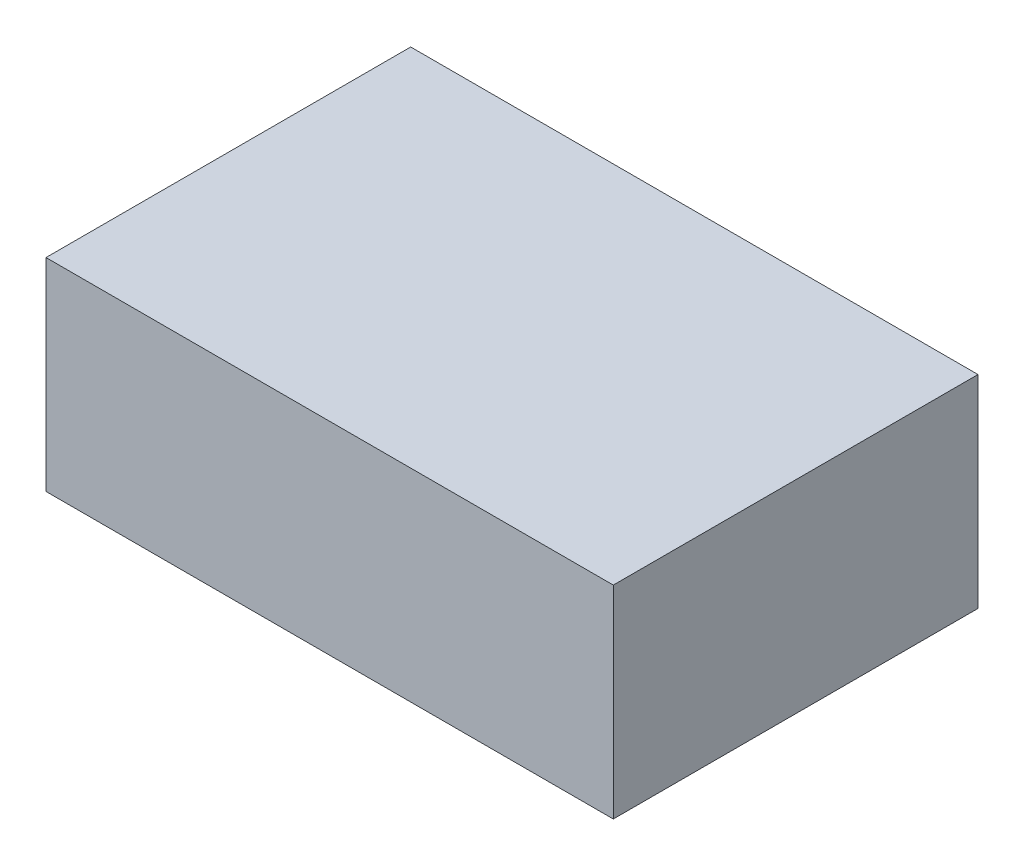
ISO-10303-21;
HEADER;
FILE_DESCRIPTION(('STEP AP214'),'2;1');
FILE_NAME('part.step','',(''),(''),'','','');
FILE_SCHEMA(('AUTOMOTIVE_DESIGN { 1 0 10303 214 1 1 1 1 }'));
ENDSEC;
DATA;
#1=APPLICATION_CONTEXT('core data for automotive mechanical design processes');
#2=APPLICATION_PROTOCOL_DEFINITION('international standard','automotive_design',2000,#1);
#3=PRODUCT_CONTEXT('',#1,'mechanical');
#4=PRODUCT('Part','Part','',(#3));
#5=PRODUCT_RELATED_PRODUCT_CATEGORY('part','',(#4));
#6=PRODUCT_DEFINITION_FORMATION('','',#4);
#7=PRODUCT_DEFINITION_CONTEXT('part definition',#1,'design');
#8=PRODUCT_DEFINITION('design','',#6,#7);
#9=PRODUCT_DEFINITION_SHAPE('','',#8);
#10=(LENGTH_UNIT() NAMED_UNIT(*) SI_UNIT(.MILLI.,.METRE.));
#11=(NAMED_UNIT(*) PLANE_ANGLE_UNIT() SI_UNIT($,.RADIAN.));
#12=(NAMED_UNIT(*) SI_UNIT($,.STERADIAN.) SOLID_ANGLE_UNIT());
#13=UNCERTAINTY_MEASURE_WITH_UNIT(LENGTH_MEASURE(1.E-05),#10,'distance_accuracy_value','');
#14=(GEOMETRIC_REPRESENTATION_CONTEXT(3) GLOBAL_UNCERTAINTY_ASSIGNED_CONTEXT((#13)) GLOBAL_UNIT_ASSIGNED_CONTEXT((#10,
#11,#12)) REPRESENTATION_CONTEXT('',''));
#15=CARTESIAN_POINT('',(0.,0.,0.));
#16=DIRECTION('',(0.,0.,1.));
#17=DIRECTION('',(1.,0.,0.));
#18=AXIS2_PLACEMENT_3D('',#15,#16,#17);
#19=CARTESIAN_POINT('',(7.,5.,4.5));
#20=DIRECTION('',(-1.,0.,0.));
#21=DIRECTION('',(0.,0.,1.));
#22=AXIS2_PLACEMENT_3D('',#19,#20,#21);
#23=PLANE('',#22);
#24=DIRECTION('',(0.,0.,-1.));
#25=VECTOR('',#24,1.);
#26=CARTESIAN_POINT('',(7.,0.,4.5));
#27=LINE('',#26,#25);
#28=CARTESIAN_POINT('',(7.,0.,4.5));
#29=VERTEX_POINT('',#28);
#30=CARTESIAN_POINT('',(7.,0.,-4.5));
#31=VERTEX_POINT('',#30);
#32=EDGE_CURVE('E107',#29,#31,#27,.T.);
#33=ORIENTED_EDGE('',*,*,#32,.T.);
#34=DIRECTION('',(0.,-1.,0.));
#35=VECTOR('',#34,1.);
#36=CARTESIAN_POINT('',(7.,5.,-4.5));
#37=LINE('',#36,#35);
#38=CARTESIAN_POINT('',(7.,5.,-4.5));
#39=VERTEX_POINT('',#38);
#40=EDGE_CURVE('E11',#39,#31,#37,.T.);
#41=ORIENTED_EDGE('',*,*,#40,.F.);
#42=DIRECTION('',(0.,0.,-1.));
#43=VECTOR('',#42,1.);
#44=CARTESIAN_POINT('',(7.,5.,4.5));
#45=LINE('',#44,#43);
#46=CARTESIAN_POINT('',(7.,5.,4.5));
#47=VERTEX_POINT('',#46);
#48=EDGE_CURVE('E91',#47,#39,#45,.T.);
#49=ORIENTED_EDGE('',*,*,#48,.F.);
#50=DIRECTION('',(0.,-1.,0.));
#51=VECTOR('',#50,1.);
#52=CARTESIAN_POINT('',(7.,5.,4.5));
#53=LINE('',#52,#51);
#54=EDGE_CURVE('E103',#47,#29,#53,.T.);
#55=ORIENTED_EDGE('',*,*,#54,.T.);
#56=EDGE_LOOP('',(#33,#41,#49,#55));
#57=FACE_BOUND('',#56,.T.);
#58=ADVANCED_FACE('F39',(#57),#23,.F.);
#59=CARTESIAN_POINT('',(-7.,5.,-4.5));
#60=DIRECTION('',(0.,0.,1.));
#61=DIRECTION('',(1.,0.,0.));
#62=AXIS2_PLACEMENT_3D('',#59,#60,#61);
#63=PLANE('',#62);
#64=DIRECTION('',(-1.,0.,0.));
#65=VECTOR('',#64,1.);
#66=CARTESIAN_POINT('',(-7.,0.,-4.5));
#67=LINE('',#66,#65);
#68=CARTESIAN_POINT('',(-7.,0.,-4.5));
#69=VERTEX_POINT('',#68);
#70=EDGE_CURVE('E96',#31,#69,#67,.T.);
#71=ORIENTED_EDGE('',*,*,#70,.T.);
#72=DIRECTION('',(0.,-1.,0.));
#73=VECTOR('',#72,1.);
#74=CARTESIAN_POINT('',(-7.,5.,-4.5));
#75=LINE('',#74,#73);
#76=CARTESIAN_POINT('',(-7.,5.,-4.5));
#77=VERTEX_POINT('',#76);
#78=EDGE_CURVE('E48',#77,#69,#75,.T.);
#79=ORIENTED_EDGE('',*,*,#78,.F.);
#80=DIRECTION('',(-1.,0.,0.));
#81=VECTOR('',#80,1.);
#82=CARTESIAN_POINT('',(-7.,5.,-4.5));
#83=LINE('',#82,#81);
#84=EDGE_CURVE('E86',#39,#77,#83,.T.);
#85=ORIENTED_EDGE('',*,*,#84,.F.);
#86=ORIENTED_EDGE('',*,*,#40,.T.);
#87=EDGE_LOOP('',(#71,#79,#85,#86));
#88=FACE_BOUND('',#87,.T.);
#89=ADVANCED_FACE('F95',(#88),#63,.F.);
#90=CARTESIAN_POINT('',(-7.,5.,4.5));
#91=DIRECTION('',(1.,0.,0.));
#92=DIRECTION('',(0.,0.,-1.));
#93=AXIS2_PLACEMENT_3D('',#90,#91,#92);
#94=PLANE('',#93);
#95=DIRECTION('',(0.,0.,1.));
#96=VECTOR('',#95,1.);
#97=CARTESIAN_POINT('',(-7.,0.,4.5));
#98=LINE('',#97,#96);
#99=CARTESIAN_POINT('',(-7.,0.,4.5));
#100=VERTEX_POINT('',#99);
#101=EDGE_CURVE('E73',#69,#100,#98,.T.);
#102=ORIENTED_EDGE('',*,*,#101,.T.);
#103=DIRECTION('',(0.,-1.,0.));
#104=VECTOR('',#103,1.);
#105=CARTESIAN_POINT('',(-7.,5.,4.5));
#106=LINE('',#105,#104);
#107=CARTESIAN_POINT('',(-7.,5.,4.5));
#108=VERTEX_POINT('',#107);
#109=EDGE_CURVE('E98',#108,#100,#106,.T.);
#110=ORIENTED_EDGE('',*,*,#109,.F.);
#111=DIRECTION('',(0.,0.,1.));
#112=VECTOR('',#111,1.);
#113=CARTESIAN_POINT('',(-7.,5.,4.5));
#114=LINE('',#113,#112);
#115=EDGE_CURVE('E89',#77,#108,#114,.T.);
#116=ORIENTED_EDGE('',*,*,#115,.F.);
#117=ORIENTED_EDGE('',*,*,#78,.T.);
#118=EDGE_LOOP('',(#102,#110,#116,#117));
#119=FACE_BOUND('',#118,.T.);
#120=ADVANCED_FACE('F99',(#119),#94,.F.);
#121=CARTESIAN_POINT('',(-7.,5.,4.5));
#122=DIRECTION('',(0.,0.,-1.));
#123=DIRECTION('',(-1.,0.,0.));
#124=AXIS2_PLACEMENT_3D('',#121,#122,#123);
#125=PLANE('',#124);
#126=DIRECTION('',(1.,0.,0.));
#127=VECTOR('',#126,1.);
#128=CARTESIAN_POINT('',(-7.,0.,4.5));
#129=LINE('',#128,#127);
#130=EDGE_CURVE('E79',#100,#29,#129,.T.);
#131=ORIENTED_EDGE('',*,*,#130,.T.);
#132=ORIENTED_EDGE('',*,*,#54,.F.);
#133=DIRECTION('',(1.,0.,0.));
#134=VECTOR('',#133,1.);
#135=CARTESIAN_POINT('',(-7.,5.,4.5));
#136=LINE('',#135,#134);
#137=EDGE_CURVE('E56',#108,#47,#136,.T.);
#138=ORIENTED_EDGE('',*,*,#137,.F.);
#139=ORIENTED_EDGE('',*,*,#109,.T.);
#140=EDGE_LOOP('',(#131,#132,#138,#139));
#141=FACE_BOUND('',#140,.T.);
#142=ADVANCED_FACE('F120',(#141),#125,.F.);
#143=CARTESIAN_POINT('',(0.,5.,0.));
#144=DIRECTION('',(0.,-1.,0.));
#145=DIRECTION('',(0.,0.,-1.));
#146=AXIS2_PLACEMENT_3D('',#143,#144,#145);
#147=PLANE('',#146);
#148=ORIENTED_EDGE('',*,*,#48,.T.);
#149=ORIENTED_EDGE('',*,*,#84,.T.);
#150=ORIENTED_EDGE('',*,*,#115,.T.);
#151=ORIENTED_EDGE('',*,*,#137,.T.);
#152=EDGE_LOOP('',(#148,#149,#150,#151));
#153=FACE_BOUND('',#152,.T.);
#154=ADVANCED_FACE('F87',(#153),#147,.F.);
#155=CARTESIAN_POINT('',(0.,0.,0.));
#156=DIRECTION('',(0.,-1.,0.));
#157=DIRECTION('',(0.,0.,-1.));
#158=AXIS2_PLACEMENT_3D('',#155,#156,#157);
#159=PLANE('',#158);
#160=ORIENTED_EDGE('',*,*,#32,.F.);
#161=ORIENTED_EDGE('',*,*,#130,.F.);
#162=ORIENTED_EDGE('',*,*,#101,.F.);
#163=ORIENTED_EDGE('',*,*,#70,.F.);
#164=EDGE_LOOP('',(#160,#161,#162,#163));
#165=FACE_BOUND('',#164,.T.);
#166=ADVANCED_FACE('F123',(#165),#159,.T.);
#167=CLOSED_SHELL('',(#58,#89,#120,#142,#154,#166));
#168=MANIFOLD_SOLID_BREP('B2',#167);
#169=ADVANCED_BREP_SHAPE_REPRESENTATION('',(#18,#168),#14);
#170=SHAPE_DEFINITION_REPRESENTATION(#9,#169);
ENDSEC;
END-ISO-10303-21;
